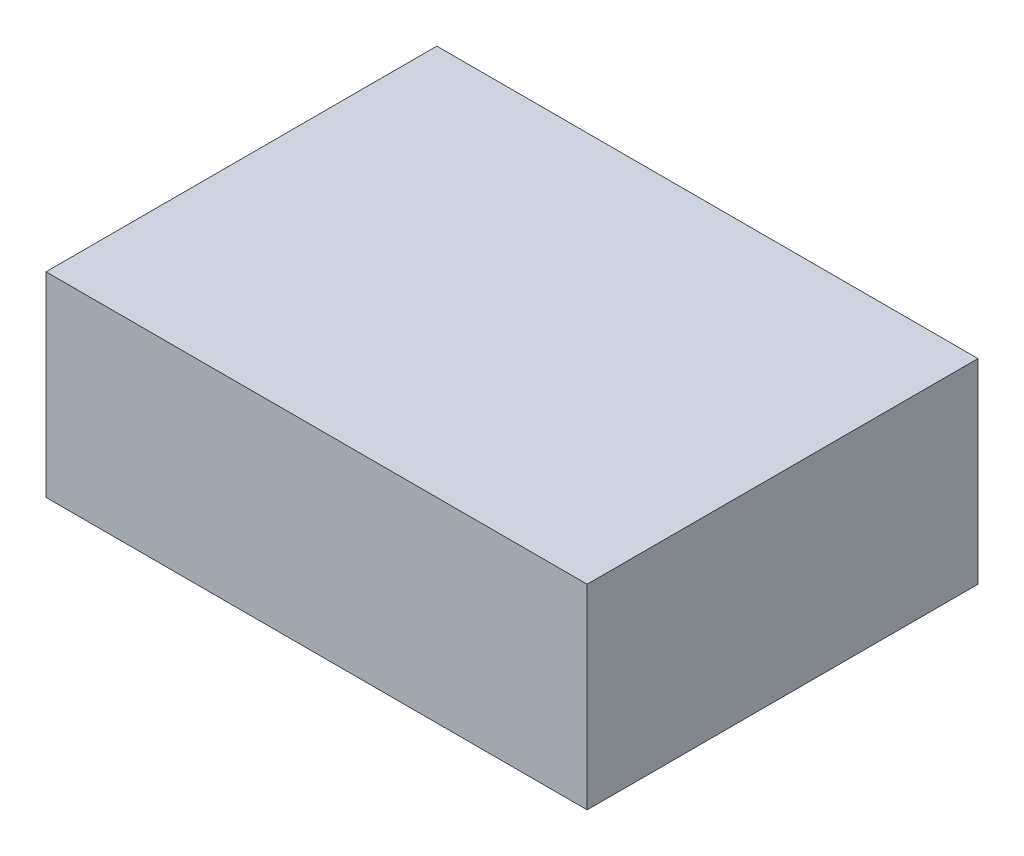
ISO-10303-21;
HEADER;
FILE_DESCRIPTION(('STEP AP214'),'2;1');
FILE_NAME('part.step','',(''),(''),'','','');
FILE_SCHEMA(('AUTOMOTIVE_DESIGN { 1 0 10303 214 1 1 1 1 }'));
ENDSEC;
DATA;
#1=APPLICATION_CONTEXT('core data for automotive mechanical design processes');
#2=APPLICATION_PROTOCOL_DEFINITION('international standard','automotive_design',2000,#1);
#3=PRODUCT_CONTEXT('',#1,'mechanical');
#4=PRODUCT('Part','Part','',(#3));
#5=PRODUCT_RELATED_PRODUCT_CATEGORY('part','',(#4));
#6=PRODUCT_DEFINITION_FORMATION('','',#4);
#7=PRODUCT_DEFINITION_CONTEXT('part definition',#1,'design');
#8=PRODUCT_DEFINITION('design','',#6,#7);
#9=PRODUCT_DEFINITION_SHAPE('','',#8);
#10=(LENGTH_UNIT() NAMED_UNIT(*) SI_UNIT(.MILLI.,.METRE.));
#11=(NAMED_UNIT(*) PLANE_ANGLE_UNIT() SI_UNIT($,.RADIAN.));
#12=(NAMED_UNIT(*) SI_UNIT($,.STERADIAN.) SOLID_ANGLE_UNIT());
#13=UNCERTAINTY_MEASURE_WITH_UNIT(LENGTH_MEASURE(1.E-05),#10,'distance_accuracy_value','');
#14=(GEOMETRIC_REPRESENTATION_CONTEXT(3) GLOBAL_UNCERTAINTY_ASSIGNED_CONTEXT((#13)) GLOBAL_UNIT_ASSIGNED_CONTEXT((#10,
#11,#12)) REPRESENTATION_CONTEXT('',''));
#15=CARTESIAN_POINT('',(0.,0.,0.));
#16=DIRECTION('',(0.,0.,1.));
#17=DIRECTION('',(1.,0.,0.));
#18=AXIS2_PLACEMENT_3D('',#15,#16,#17);
#19=CARTESIAN_POINT('',(0.,13.,0.));
#20=DIRECTION('',(1.,0.,0.));
#21=DIRECTION('',(0.,0.,1.));
#22=AXIS2_PLACEMENT_3D('',#19,#20,#21);
#23=PLANE('',#22);
#24=DIRECTION('',(0.,0.,-1.));
#25=VECTOR('',#24,1.);
#26=CARTESIAN_POINT('',(0.,0.,0.));
#27=LINE('',#26,#25);
#28=CARTESIAN_POINT('',(0.,0.,26.));
#29=VERTEX_POINT('',#28);
#30=CARTESIAN_POINT('',(0.,0.,0.));
#31=VERTEX_POINT('',#30);
#32=EDGE_CURVE('E98',#29,#31,#27,.T.);
#33=ORIENTED_EDGE('',*,*,#32,.F.);
#34=DIRECTION('',(0.,-1.,0.));
#35=VECTOR('',#34,1.);
#36=CARTESIAN_POINT('',(0.,13.,26.));
#37=LINE('',#36,#35);
#38=CARTESIAN_POINT('',(0.,13.,26.));
#39=VERTEX_POINT('',#38);
#40=EDGE_CURVE('E97',#39,#29,#37,.T.);
#41=ORIENTED_EDGE('',*,*,#40,.F.);
#42=DIRECTION('',(0.,0.,-1.));
#43=VECTOR('',#42,1.);
#44=CARTESIAN_POINT('',(0.,13.,0.));
#45=LINE('',#44,#43);
#46=CARTESIAN_POINT('',(0.,13.,0.));
#47=VERTEX_POINT('',#46);
#48=EDGE_CURVE('E92',#39,#47,#45,.T.);
#49=ORIENTED_EDGE('',*,*,#48,.T.);
#50=DIRECTION('',(0.,-1.,0.));
#51=VECTOR('',#50,1.);
#52=CARTESIAN_POINT('',(0.,13.,0.));
#53=LINE('',#52,#51);
#54=EDGE_CURVE('E11',#47,#31,#53,.T.);
#55=ORIENTED_EDGE('',*,*,#54,.T.);
#56=EDGE_LOOP('',(#33,#41,#49,#55));
#57=FACE_BOUND('',#56,.T.);
#58=ADVANCED_FACE('F35',(#57),#23,.F.);
#59=CARTESIAN_POINT('',(0.,13.,0.));
#60=DIRECTION('',(0.,0.,1.));
#61=DIRECTION('',(-1.,0.,0.));
#62=AXIS2_PLACEMENT_3D('',#59,#60,#61);
#63=PLANE('',#62);
#64=DIRECTION('',(1.,0.,0.));
#65=VECTOR('',#64,1.);
#66=CARTESIAN_POINT('',(0.,0.,0.));
#67=LINE('',#66,#65);
#68=CARTESIAN_POINT('',(36.,0.,0.));
#69=VERTEX_POINT('',#68);
#70=EDGE_CURVE('E100',#31,#69,#67,.T.);
#71=ORIENTED_EDGE('',*,*,#70,.F.);
#72=ORIENTED_EDGE('',*,*,#54,.F.);
#73=DIRECTION('',(1.,0.,0.));
#74=VECTOR('',#73,1.);
#75=CARTESIAN_POINT('',(0.,13.,0.));
#76=LINE('',#75,#74);
#77=CARTESIAN_POINT('',(36.,13.,0.));
#78=VERTEX_POINT('',#77);
#79=EDGE_CURVE('E76',#47,#78,#76,.T.);
#80=ORIENTED_EDGE('',*,*,#79,.T.);
#81=DIRECTION('',(0.,-1.,0.));
#82=VECTOR('',#81,1.);
#83=CARTESIAN_POINT('',(36.,13.,0.));
#84=LINE('',#83,#82);
#85=EDGE_CURVE('E43',#78,#69,#84,.T.);
#86=ORIENTED_EDGE('',*,*,#85,.T.);
#87=EDGE_LOOP('',(#71,#72,#80,#86));
#88=FACE_BOUND('',#87,.T.);
#89=ADVANCED_FACE('F90',(#88),#63,.F.);
#90=CARTESIAN_POINT('',(36.,13.,0.));
#91=DIRECTION('',(-1.,0.,0.));
#92=DIRECTION('',(0.,0.,-1.));
#93=AXIS2_PLACEMENT_3D('',#90,#91,#92);
#94=PLANE('',#93);
#95=DIRECTION('',(0.,0.,1.));
#96=VECTOR('',#95,1.);
#97=CARTESIAN_POINT('',(36.,0.,0.));
#98=LINE('',#97,#96);
#99=CARTESIAN_POINT('',(36.,0.,26.));
#100=VERTEX_POINT('',#99);
#101=EDGE_CURVE('E86',#69,#100,#98,.T.);
#102=ORIENTED_EDGE('',*,*,#101,.F.);
#103=ORIENTED_EDGE('',*,*,#85,.F.);
#104=DIRECTION('',(0.,0.,1.));
#105=VECTOR('',#104,1.);
#106=CARTESIAN_POINT('',(36.,13.,0.));
#107=LINE('',#106,#105);
#108=CARTESIAN_POINT('',(36.,13.,26.));
#109=VERTEX_POINT('',#108);
#110=EDGE_CURVE('E79',#78,#109,#107,.T.);
#111=ORIENTED_EDGE('',*,*,#110,.T.);
#112=DIRECTION('',(0.,-1.,0.));
#113=VECTOR('',#112,1.);
#114=CARTESIAN_POINT('',(36.,13.,26.));
#115=LINE('',#114,#113);
#116=EDGE_CURVE('E89',#109,#100,#115,.T.);
#117=ORIENTED_EDGE('',*,*,#116,.T.);
#118=EDGE_LOOP('',(#102,#103,#111,#117));
#119=FACE_BOUND('',#118,.T.);
#120=ADVANCED_FACE('F85',(#119),#94,.F.);
#121=CARTESIAN_POINT('',(0.,13.,26.));
#122=DIRECTION('',(0.,0.,-1.));
#123=DIRECTION('',(1.,0.,0.));
#124=AXIS2_PLACEMENT_3D('',#121,#122,#123);
#125=PLANE('',#124);
#126=DIRECTION('',(-1.,0.,0.));
#127=VECTOR('',#126,1.);
#128=CARTESIAN_POINT('',(0.,0.,26.));
#129=LINE('',#128,#127);
#130=EDGE_CURVE('E65',#100,#29,#129,.T.);
#131=ORIENTED_EDGE('',*,*,#130,.F.);
#132=ORIENTED_EDGE('',*,*,#116,.F.);
#133=DIRECTION('',(-1.,0.,0.));
#134=VECTOR('',#133,1.);
#135=CARTESIAN_POINT('',(0.,13.,26.));
#136=LINE('',#135,#134);
#137=EDGE_CURVE('E51',#109,#39,#136,.T.);
#138=ORIENTED_EDGE('',*,*,#137,.T.);
#139=ORIENTED_EDGE('',*,*,#40,.T.);
#140=EDGE_LOOP('',(#131,#132,#138,#139));
#141=FACE_BOUND('',#140,.T.);
#142=ADVANCED_FACE('F109',(#141),#125,.F.);
#143=CARTESIAN_POINT('',(0.,13.,0.));
#144=DIRECTION('',(0.,-1.,0.));
#145=DIRECTION('',(0.,0.,1.));
#146=AXIS2_PLACEMENT_3D('',#143,#144,#145);
#147=PLANE('',#146);
#148=ORIENTED_EDGE('',*,*,#48,.F.);
#149=ORIENTED_EDGE('',*,*,#137,.F.);
#150=ORIENTED_EDGE('',*,*,#110,.F.);
#151=ORIENTED_EDGE('',*,*,#79,.F.);
#152=EDGE_LOOP('',(#148,#149,#150,#151));
#153=FACE_BOUND('',#152,.T.);
#154=ADVANCED_FACE('F81',(#153),#147,.F.);
#155=CARTESIAN_POINT('',(0.,0.,0.));
#156=DIRECTION('',(0.,-1.,0.));
#157=DIRECTION('',(0.,0.,1.));
#158=AXIS2_PLACEMENT_3D('',#155,#156,#157);
#159=PLANE('',#158);
#160=ORIENTED_EDGE('',*,*,#32,.T.);
#161=ORIENTED_EDGE('',*,*,#70,.T.);
#162=ORIENTED_EDGE('',*,*,#101,.T.);
#163=ORIENTED_EDGE('',*,*,#130,.T.);
#164=EDGE_LOOP('',(#160,#161,#162,#163));
#165=FACE_BOUND('',#164,.T.);
#166=ADVANCED_FACE('F105',(#165),#159,.T.);
#167=CLOSED_SHELL('',(#58,#89,#120,#142,#154,#166));
#168=MANIFOLD_SOLID_BREP('B2',#167);
#169=ADVANCED_BREP_SHAPE_REPRESENTATION('',(#18,#168),#14);
#170=SHAPE_DEFINITION_REPRESENTATION(#9,#169);
ENDSEC;
END-ISO-10303-21;
